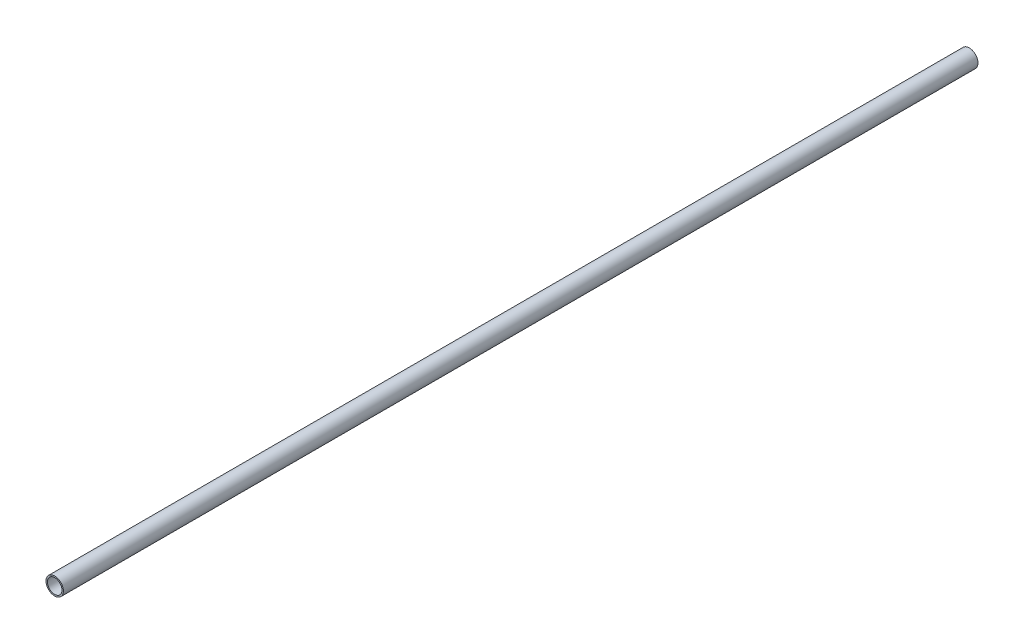
ISO-10303-21;
HEADER;
FILE_DESCRIPTION(('STEP AP214'),'2;1');
FILE_NAME('part.step','',(''),(''),'','','');
FILE_SCHEMA(('AUTOMOTIVE_DESIGN { 1 0 10303 214 1 1 1 1 }'));
ENDSEC;
DATA;
#1=APPLICATION_CONTEXT('core data for automotive mechanical design processes');
#2=APPLICATION_PROTOCOL_DEFINITION('international standard','automotive_design',2000,#1);
#3=PRODUCT_CONTEXT('',#1,'mechanical');
#4=PRODUCT('Part','Part','',(#3));
#5=PRODUCT_RELATED_PRODUCT_CATEGORY('part','',(#4));
#6=PRODUCT_DEFINITION_FORMATION('','',#4);
#7=PRODUCT_DEFINITION_CONTEXT('part definition',#1,'design');
#8=PRODUCT_DEFINITION('design','',#6,#7);
#9=PRODUCT_DEFINITION_SHAPE('','',#8);
#10=(LENGTH_UNIT() NAMED_UNIT(*) SI_UNIT(.MILLI.,.METRE.));
#11=(NAMED_UNIT(*) PLANE_ANGLE_UNIT() SI_UNIT($,.RADIAN.));
#12=(NAMED_UNIT(*) SI_UNIT($,.STERADIAN.) SOLID_ANGLE_UNIT());
#13=UNCERTAINTY_MEASURE_WITH_UNIT(LENGTH_MEASURE(1.E-05),#10,'distance_accuracy_value','');
#14=(GEOMETRIC_REPRESENTATION_CONTEXT(3) GLOBAL_UNCERTAINTY_ASSIGNED_CONTEXT((#13)) GLOBAL_UNIT_ASSIGNED_CONTEXT((#10,
#11,#12)) REPRESENTATION_CONTEXT('',''));
#15=CARTESIAN_POINT('',(0.,0.,0.));
#16=DIRECTION('',(0.,0.,1.));
#17=DIRECTION('',(1.,0.,0.));
#18=AXIS2_PLACEMENT_3D('',#15,#16,#17);
#19=CARTESIAN_POINT('',(0.,0.,-1000.125));
#20=DIRECTION('',(0.,0.,-1.));
#21=DIRECTION('',(1.,0.,0.));
#22=AXIS2_PLACEMENT_3D('',#19,#20,#21);
#23=PLANE('',#22);
#24=CARTESIAN_POINT('',(0.,0.,-1000.125));
#25=DIRECTION('',(0.,0.,1.));
#26=DIRECTION('',(1.,0.,0.));
#27=AXIS2_PLACEMENT_3D('',#24,#25,#26);
#28=CIRCLE('',#27,9.525);
#29=CARTESIAN_POINT('',(9.525,0.,-1000.125));
#30=VERTEX_POINT('',#29);
#31=EDGE_CURVE('E10',#30,#30,#28,.T.);
#32=ORIENTED_EDGE('',*,*,#31,.F.);
#33=EDGE_LOOP('',(#32));
#34=FACE_BOUND('',#33,.T.);
#35=CARTESIAN_POINT('',(0.,0.,-1000.125));
#36=DIRECTION('',(0.,0.,1.));
#37=DIRECTION('',(1.,0.,0.));
#38=AXIS2_PLACEMENT_3D('',#35,#36,#37);
#39=CIRCLE('',#38,7.9375);
#40=CARTESIAN_POINT('',(7.9375,0.,-1000.125));
#41=VERTEX_POINT('',#40);
#42=EDGE_CURVE('E52',#41,#41,#39,.T.);
#43=ORIENTED_EDGE('',*,*,#42,.T.);
#44=EDGE_LOOP('',(#43));
#45=FACE_BOUND('',#44,.T.);
#46=ADVANCED_FACE('F41',(#34,#45),#23,.T.);
#47=CARTESIAN_POINT('',(0.,0.,0.));
#48=DIRECTION('',(0.,0.,-1.));
#49=DIRECTION('',(1.,0.,0.));
#50=AXIS2_PLACEMENT_3D('',#47,#48,#49);
#51=PLANE('',#50);
#52=CARTESIAN_POINT('',(0.,0.,0.));
#53=DIRECTION('',(0.,0.,1.));
#54=DIRECTION('',(1.,0.,0.));
#55=AXIS2_PLACEMENT_3D('',#52,#53,#54);
#56=CIRCLE('',#55,9.525);
#57=CARTESIAN_POINT('',(9.525,0.,0.));
#58=VERTEX_POINT('',#57);
#59=EDGE_CURVE('E45',#58,#58,#56,.T.);
#60=ORIENTED_EDGE('',*,*,#59,.T.);
#61=EDGE_LOOP('',(#60));
#62=FACE_BOUND('',#61,.T.);
#63=CARTESIAN_POINT('',(0.,0.,0.));
#64=DIRECTION('',(0.,0.,1.));
#65=DIRECTION('',(1.,0.,0.));
#66=AXIS2_PLACEMENT_3D('',#63,#64,#65);
#67=CIRCLE('',#66,7.9375);
#68=CARTESIAN_POINT('',(7.9375,0.,0.));
#69=VERTEX_POINT('',#68);
#70=EDGE_CURVE('E54',#69,#69,#67,.T.);
#71=ORIENTED_EDGE('',*,*,#70,.F.);
#72=EDGE_LOOP('',(#71));
#73=FACE_BOUND('',#72,.T.);
#74=ADVANCED_FACE('F67',(#62,#73),#51,.F.);
#75=CARTESIAN_POINT('',(0.,0.,-1000.125));
#76=DIRECTION('',(0.,0.,1.));
#77=DIRECTION('',(-1.,0.,0.));
#78=AXIS2_PLACEMENT_3D('',#75,#76,#77);
#79=CYLINDRICAL_SURFACE('',#78,9.525);
#80=ORIENTED_EDGE('',*,*,#31,.T.);
#81=EDGE_LOOP('',(#80));
#82=FACE_BOUND('',#81,.T.);
#83=ORIENTED_EDGE('',*,*,#59,.F.);
#84=EDGE_LOOP('',(#83));
#85=FACE_BOUND('',#84,.T.);
#86=ADVANCED_FACE('F43',(#82,#85),#79,.T.);
#87=CARTESIAN_POINT('',(0.,0.,-1000.125));
#88=DIRECTION('',(0.,0.,1.));
#89=DIRECTION('',(-1.,0.,0.));
#90=AXIS2_PLACEMENT_3D('',#87,#88,#89);
#91=CYLINDRICAL_SURFACE('',#90,7.9375);
#92=ORIENTED_EDGE('',*,*,#42,.F.);
#93=EDGE_LOOP('',(#92));
#94=FACE_BOUND('',#93,.T.);
#95=ORIENTED_EDGE('',*,*,#70,.T.);
#96=EDGE_LOOP('',(#95));
#97=FACE_BOUND('',#96,.T.);
#98=ADVANCED_FACE('F61',(#94,#97),#91,.F.);
#99=CLOSED_SHELL('',(#46,#74,#86,#98));
#100=MANIFOLD_SOLID_BREP('B2',#99);
#101=ADVANCED_BREP_SHAPE_REPRESENTATION('',(#18,#100),#14);
#102=SHAPE_DEFINITION_REPRESENTATION(#9,#101);
ENDSEC;
END-ISO-10303-21;
